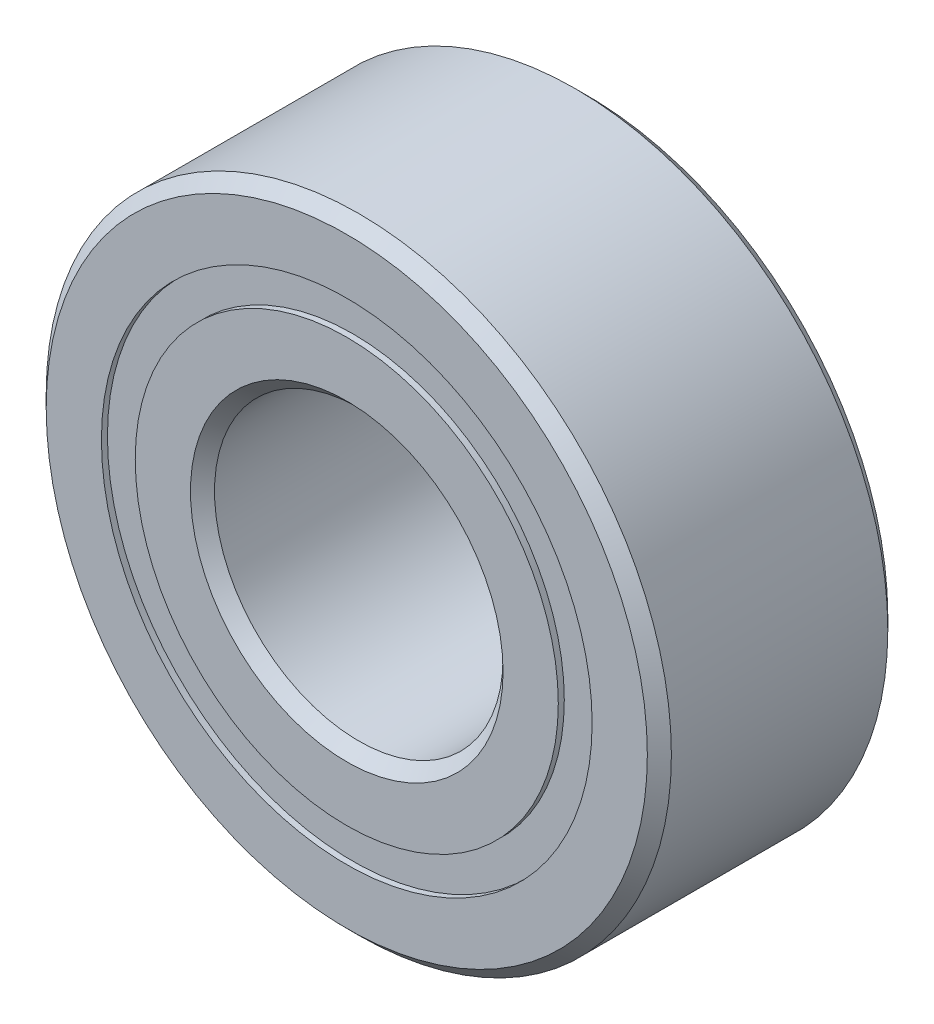
ISO-10303-21;
HEADER;
FILE_DESCRIPTION(('STEP AP214'),'2;1');
FILE_NAME('part.step','',(''),(''),'','','');
FILE_SCHEMA(('AUTOMOTIVE_DESIGN { 1 0 10303 214 1 1 1 1 }'));
ENDSEC;
DATA;
#1=APPLICATION_CONTEXT('core data for automotive mechanical design processes');
#2=APPLICATION_PROTOCOL_DEFINITION('international standard','automotive_design',2000,#1);
#3=PRODUCT_CONTEXT('',#1,'mechanical');
#4=PRODUCT('Part','Part','',(#3));
#5=PRODUCT_RELATED_PRODUCT_CATEGORY('part','',(#4));
#6=PRODUCT_DEFINITION_FORMATION('','',#4);
#7=PRODUCT_DEFINITION_CONTEXT('part definition',#1,'design');
#8=PRODUCT_DEFINITION('design','',#6,#7);
#9=PRODUCT_DEFINITION_SHAPE('','',#8);
#10=(LENGTH_UNIT() NAMED_UNIT(*) SI_UNIT(.MILLI.,.METRE.));
#11=(NAMED_UNIT(*) PLANE_ANGLE_UNIT() SI_UNIT($,.RADIAN.));
#12=(NAMED_UNIT(*) SI_UNIT($,.STERADIAN.) SOLID_ANGLE_UNIT());
#13=UNCERTAINTY_MEASURE_WITH_UNIT(LENGTH_MEASURE(1.E-05),#10,'distance_accuracy_value','');
#14=(GEOMETRIC_REPRESENTATION_CONTEXT(3) GLOBAL_UNCERTAINTY_ASSIGNED_CONTEXT((#13)) GLOBAL_UNIT_ASSIGNED_CONTEXT((#10,
#11,#12)) REPRESENTATION_CONTEXT('',''));
#15=CARTESIAN_POINT('',(0.,0.,0.));
#16=DIRECTION('',(0.,0.,1.));
#17=DIRECTION('',(1.,0.,0.));
#18=AXIS2_PLACEMENT_3D('',#15,#16,#17);
#19=CARTESIAN_POINT('',(0.,5.10164835164835,-2.375));
#20=DIRECTION('',(0.,0.,1.));
#21=DIRECTION('',(1.,0.,0.));
#22=AXIS2_PLACEMENT_3D('',#19,#20,#21);
#23=PLANE('',#22);
#24=CARTESIAN_POINT('',(0.,0.,-2.375));
#25=DIRECTION('',(0.,0.,1.));
#26=DIRECTION('',(1.,0.,0.));
#27=AXIS2_PLACEMENT_3D('',#24,#25,#26);
#28=CIRCLE('',#27,5.10164835164835);
#29=CARTESIAN_POINT('',(5.10164835164835,0.,-2.375));
#30=VERTEX_POINT('',#29);
#31=EDGE_CURVE('E70',#30,#30,#28,.T.);
#32=ORIENTED_EDGE('',*,*,#31,.F.);
#33=EDGE_LOOP('',(#32));
#34=FACE_BOUND('',#33,.T.);
#35=CARTESIAN_POINT('',(0.,0.,-2.375));
#36=DIRECTION('',(0.,0.,1.));
#37=DIRECTION('',(1.,0.,0.));
#38=AXIS2_PLACEMENT_3D('',#35,#36,#37);
#39=CIRCLE('',#38,4.39835164835165);
#40=CARTESIAN_POINT('',(4.39835164835165,0.,-2.375));
#41=VERTEX_POINT('',#40);
#42=EDGE_CURVE('E11',#41,#41,#39,.T.);
#43=ORIENTED_EDGE('',*,*,#42,.T.);
#44=EDGE_LOOP('',(#43));
#45=FACE_BOUND('',#44,.T.);
#46=ADVANCED_FACE('F56',(#34,#45),#23,.F.);
#47=CARTESIAN_POINT('',(0.,0.,2.5));
#48=DIRECTION('',(0.,0.,1.));
#49=DIRECTION('',(1.,0.,0.));
#50=AXIS2_PLACEMENT_3D('',#47,#48,#49);
#51=CYLINDRICAL_SURFACE('',#50,4.39835164835165);
#52=ORIENTED_EDGE('',*,*,#42,.F.);
#53=EDGE_LOOP('',(#52));
#54=FACE_BOUND('',#53,.T.);
#55=CARTESIAN_POINT('',(0.,0.,-1.16542887575844));
#56=DIRECTION('',(0.,0.,1.));
#57=DIRECTION('',(1.,0.,0.));
#58=AXIS2_PLACEMENT_3D('',#55,#56,#57);
#59=CIRCLE('',#58,4.39835164835165);
#60=CARTESIAN_POINT('',(4.39835164835165,0.,-1.16542887575844));
#61=VERTEX_POINT('',#60);
#62=EDGE_CURVE('E62',#61,#61,#59,.T.);
#63=ORIENTED_EDGE('',*,*,#62,.T.);
#64=EDGE_LOOP('',(#63));
#65=FACE_BOUND('',#64,.T.);
#66=ADVANCED_FACE('F79',(#54,#65),#51,.F.);
#67=CARTESIAN_POINT('',(0.,5.10164835164835,-1.16542887575844));
#68=DIRECTION('',(0.,0.,-1.));
#69=DIRECTION('',(-1.,0.,0.));
#70=AXIS2_PLACEMENT_3D('',#67,#68,#69);
#71=PLANE('',#70);
#72=ORIENTED_EDGE('',*,*,#62,.F.);
#73=EDGE_LOOP('',(#72));
#74=FACE_BOUND('',#73,.T.);
#75=CARTESIAN_POINT('',(0.,0.,-1.16542887575844));
#76=DIRECTION('',(0.,0.,1.));
#77=DIRECTION('',(1.,0.,0.));
#78=AXIS2_PLACEMENT_3D('',#75,#76,#77);
#79=CIRCLE('',#78,5.10164835164835);
#80=CARTESIAN_POINT('',(5.10164835164835,0.,-1.16542887575844));
#81=VERTEX_POINT('',#80);
#82=EDGE_CURVE('E66',#81,#81,#79,.T.);
#83=ORIENTED_EDGE('',*,*,#82,.T.);
#84=EDGE_LOOP('',(#83));
#85=FACE_BOUND('',#84,.T.);
#86=ADVANCED_FACE('F83',(#74,#85),#71,.F.);
#87=CARTESIAN_POINT('',(0.,0.,2.5));
#88=DIRECTION('',(0.,0.,1.));
#89=DIRECTION('',(1.,0.,0.));
#90=AXIS2_PLACEMENT_3D('',#87,#88,#89);
#91=CYLINDRICAL_SURFACE('',#90,5.10164835164835);
#92=ORIENTED_EDGE('',*,*,#82,.F.);
#93=EDGE_LOOP('',(#92));
#94=FACE_BOUND('',#93,.T.);
#95=ORIENTED_EDGE('',*,*,#31,.T.);
#96=EDGE_LOOP('',(#95));
#97=FACE_BOUND('',#96,.T.);
#98=ADVANCED_FACE('F76',(#94,#97),#91,.T.);
#99=CLOSED_SHELL('',(#46,#66,#86,#98));
#100=MANIFOLD_SOLID_BREP('B2',#99);
#101=CARTESIAN_POINT('',(0.,5.10164835164835,2.375));
#102=DIRECTION('',(0.,0.,-1.));
#103=DIRECTION('',(-1.,0.,0.));
#104=AXIS2_PLACEMENT_3D('',#101,#102,#103);
#105=PLANE('',#104);
#106=CARTESIAN_POINT('',(0.,0.,2.375));
#107=DIRECTION('',(0.,0.,1.));
#108=DIRECTION('',(1.,0.,0.));
#109=AXIS2_PLACEMENT_3D('',#106,#107,#108);
#110=CIRCLE('',#109,4.39835164835165);
#111=CARTESIAN_POINT('',(4.39835164835165,0.,2.375));
#112=VERTEX_POINT('',#111);
#113=EDGE_CURVE('E55',#112,#112,#110,.T.);
#114=ORIENTED_EDGE('',*,*,#113,.F.);
#115=EDGE_LOOP('',(#114));
#116=FACE_BOUND('',#115,.T.);
#117=CARTESIAN_POINT('',(0.,0.,2.375));
#118=DIRECTION('',(0.,0.,1.));
#119=DIRECTION('',(1.,0.,0.));
#120=AXIS2_PLACEMENT_3D('',#117,#118,#119);
#121=CIRCLE('',#120,5.10164835164835);
#122=CARTESIAN_POINT('',(5.10164835164835,0.,2.375));
#123=VERTEX_POINT('',#122);
#124=EDGE_CURVE('E130',#123,#123,#121,.T.);
#125=ORIENTED_EDGE('',*,*,#124,.T.);
#126=EDGE_LOOP('',(#125));
#127=FACE_BOUND('',#126,.T.);
#128=ADVANCED_FACE('F116',(#116,#127),#105,.F.);
#129=CARTESIAN_POINT('',(0.,0.,2.5));
#130=DIRECTION('',(0.,0.,1.));
#131=DIRECTION('',(1.,0.,0.));
#132=AXIS2_PLACEMENT_3D('',#129,#130,#131);
#133=CYLINDRICAL_SURFACE('',#132,4.39835164835165);
#134=CARTESIAN_POINT('',(0.,0.,1.16542887575844));
#135=DIRECTION('',(0.,0.,1.));
#136=DIRECTION('',(1.,0.,0.));
#137=AXIS2_PLACEMENT_3D('',#134,#135,#136);
#138=CIRCLE('',#137,4.39835164835165);
#139=CARTESIAN_POINT('',(4.39835164835165,0.,1.16542887575844));
#140=VERTEX_POINT('',#139);
#141=EDGE_CURVE('E122',#140,#140,#138,.T.);
#142=ORIENTED_EDGE('',*,*,#141,.F.);
#143=EDGE_LOOP('',(#142));
#144=FACE_BOUND('',#143,.T.);
#145=ORIENTED_EDGE('',*,*,#113,.T.);
#146=EDGE_LOOP('',(#145));
#147=FACE_BOUND('',#146,.T.);
#148=ADVANCED_FACE('F145',(#144,#147),#133,.F.);
#149=CARTESIAN_POINT('',(0.,5.10164835164835,1.16542887575844));
#150=DIRECTION('',(0.,0.,1.));
#151=DIRECTION('',(1.,0.,0.));
#152=AXIS2_PLACEMENT_3D('',#149,#150,#151);
#153=PLANE('',#152);
#154=CARTESIAN_POINT('',(0.,0.,1.16542887575844));
#155=DIRECTION('',(0.,0.,1.));
#156=DIRECTION('',(1.,0.,0.));
#157=AXIS2_PLACEMENT_3D('',#154,#155,#156);
#158=CIRCLE('',#157,5.10164835164835);
#159=CARTESIAN_POINT('',(5.10164835164835,0.,1.16542887575844));
#160=VERTEX_POINT('',#159);
#161=EDGE_CURVE('E126',#160,#160,#158,.T.);
#162=ORIENTED_EDGE('',*,*,#161,.F.);
#163=EDGE_LOOP('',(#162));
#164=FACE_BOUND('',#163,.T.);
#165=ORIENTED_EDGE('',*,*,#141,.T.);
#166=EDGE_LOOP('',(#165));
#167=FACE_BOUND('',#166,.T.);
#168=ADVANCED_FACE('F140',(#164,#167),#153,.F.);
#169=CARTESIAN_POINT('',(0.,0.,2.5));
#170=DIRECTION('',(0.,0.,1.));
#171=DIRECTION('',(1.,0.,0.));
#172=AXIS2_PLACEMENT_3D('',#169,#170,#171);
#173=CYLINDRICAL_SURFACE('',#172,5.10164835164835);
#174=ORIENTED_EDGE('',*,*,#124,.F.);
#175=EDGE_LOOP('',(#174));
#176=FACE_BOUND('',#175,.T.);
#177=ORIENTED_EDGE('',*,*,#161,.T.);
#178=EDGE_LOOP('',(#177));
#179=FACE_BOUND('',#178,.T.);
#180=ADVANCED_FACE('F137',(#176,#179),#173,.T.);
#181=CLOSED_SHELL('',(#128,#148,#168,#180));
#182=MANIFOLD_SOLID_BREP('B6',#181);
#183=CARTESIAN_POINT('',(-2.37499999999995,4.11362066797611,0.));
#184=DIRECTION('',(0.,0.,1.));
#185=DIRECTION('',(-0.499999999999989,0.866025403784445,0.));
#186=AXIS2_PLACEMENT_3D('',#183,#184,#185);
#187=SPHERICAL_SURFACE('',#186,1.16542887575844);
#188=CARTESIAN_POINT('',(-2.37499999999995,4.11362066797611,1.16542887575844));
#189=VERTEX_POINT('',#188);
#190=VERTEX_LOOP('',#189);
#191=FACE_BOUND('',#190,.T.);
#192=ADVANCED_FACE('F176',(#191),#187,.T.);
#193=CLOSED_SHELL('',(#192));
#194=MANIFOLD_SOLID_BREP('B50',#193);
#195=CARTESIAN_POINT('',(-4.11362066797606,2.37500000000005,0.));
#196=DIRECTION('',(0.,0.,1.));
#197=DIRECTION('',(-0.866025403784433,0.50000000000001,0.));
#198=AXIS2_PLACEMENT_3D('',#195,#196,#197);
#199=SPHERICAL_SURFACE('',#198,1.16542887575844);
#200=CARTESIAN_POINT('',(-4.11362066797606,2.37500000000005,1.16542887575844));
#201=VERTEX_POINT('',#200);
#202=VERTEX_LOOP('',#201);
#203=FACE_BOUND('',#202,.T.);
#204=ADVANCED_FACE('F199',(#203),#199,.T.);
#205=CLOSED_SHELL('',(#204));
#206=MANIFOLD_SOLID_BREP('B112',#205);
#207=CARTESIAN_POINT('',(-4.75,0.,0.));
#208=DIRECTION('',(0.,0.,1.));
#209=DIRECTION('',(-1.,0.,0.));
#210=AXIS2_PLACEMENT_3D('',#207,#208,#209);
#211=SPHERICAL_SURFACE('',#210,1.16542887575844);
#212=CARTESIAN_POINT('',(-4.75,0.,1.16542887575844));
#213=VERTEX_POINT('',#212);
#214=VERTEX_LOOP('',#213);
#215=FACE_BOUND('',#214,.T.);
#216=ADVANCED_FACE('F222',(#215),#211,.T.);
#217=CLOSED_SHELL('',(#216));
#218=MANIFOLD_SOLID_BREP('B172',#217);
#219=CARTESIAN_POINT('',(-4.1136206679761,-2.37499999999996,0.));
#220=DIRECTION('',(0.,0.,1.));
#221=DIRECTION('',(-0.866025403784443,-0.499999999999992,0.));
#222=AXIS2_PLACEMENT_3D('',#219,#220,#221);
#223=SPHERICAL_SURFACE('',#222,1.16542887575844);
#224=CARTESIAN_POINT('',(-4.1136206679761,-2.37499999999996,1.16542887575844));
#225=VERTEX_POINT('',#224);
#226=VERTEX_LOOP('',#225);
#227=FACE_BOUND('',#226,.T.);
#228=ADVANCED_FACE('F245',(#227),#223,.T.);
#229=CLOSED_SHELL('',(#228));
#230=MANIFOLD_SOLID_BREP('B195',#229);
#231=CARTESIAN_POINT('',(-2.37500000000003,-4.11362066797606,0.));
#232=DIRECTION('',(0.,0.,1.));
#233=DIRECTION('',(-0.500000000000007,-0.866025403784435,0.));
#234=AXIS2_PLACEMENT_3D('',#231,#232,#233);
#235=SPHERICAL_SURFACE('',#234,1.16542887575844);
#236=CARTESIAN_POINT('',(-2.37500000000003,-4.11362066797606,1.16542887575844));
#237=VERTEX_POINT('',#236);
#238=VERTEX_LOOP('',#237);
#239=FACE_BOUND('',#238,.T.);
#240=ADVANCED_FACE('F268',(#239),#235,.T.);
#241=CLOSED_SHELL('',(#240));
#242=MANIFOLD_SOLID_BREP('B218',#241);
#243=CARTESIAN_POINT('',(0.,-4.75,0.));
#244=DIRECTION('',(0.,0.,1.));
#245=DIRECTION('',(0.,-1.,0.));
#246=AXIS2_PLACEMENT_3D('',#243,#244,#245);
#247=SPHERICAL_SURFACE('',#246,1.16542887575844);
#248=CARTESIAN_POINT('',(0.,-4.75,1.16542887575844));
#249=VERTEX_POINT('',#248);
#250=VERTEX_LOOP('',#249);
#251=FACE_BOUND('',#250,.T.);
#252=ADVANCED_FACE('F291',(#251),#247,.T.);
#253=CLOSED_SHELL('',(#252));
#254=MANIFOLD_SOLID_BREP('B241',#253);
#255=CARTESIAN_POINT('',(2.37499999999998,-4.1136206679761,0.));
#256=DIRECTION('',(0.,0.,1.));
#257=DIRECTION('',(0.499999999999995,-0.866025403784442,0.));
#258=AXIS2_PLACEMENT_3D('',#255,#256,#257);
#259=SPHERICAL_SURFACE('',#258,1.16542887575844);
#260=CARTESIAN_POINT('',(2.37499999999998,-4.1136206679761,1.16542887575844));
#261=VERTEX_POINT('',#260);
#262=VERTEX_LOOP('',#261);
#263=FACE_BOUND('',#262,.T.);
#264=ADVANCED_FACE('F314',(#263),#259,.T.);
#265=CLOSED_SHELL('',(#264));
#266=MANIFOLD_SOLID_BREP('B264',#265);
#267=CARTESIAN_POINT('',(4.11362066797607,-2.37500000000002,0.));
#268=DIRECTION('',(0.,0.,1.));
#269=DIRECTION('',(0.866025403784436,-0.500000000000004,0.));
#270=AXIS2_PLACEMENT_3D('',#267,#268,#269);
#271=SPHERICAL_SURFACE('',#270,1.16542887575844);
#272=CARTESIAN_POINT('',(4.11362066797607,-2.37500000000002,1.16542887575844));
#273=VERTEX_POINT('',#272);
#274=VERTEX_LOOP('',#273);
#275=FACE_BOUND('',#274,.T.);
#276=ADVANCED_FACE('F337',(#275),#271,.T.);
#277=CLOSED_SHELL('',(#276));
#278=MANIFOLD_SOLID_BREP('B287',#277);
#279=CARTESIAN_POINT('',(4.75,0.,0.));
#280=DIRECTION('',(0.,0.,1.));
#281=DIRECTION('',(1.,0.,0.));
#282=AXIS2_PLACEMENT_3D('',#279,#280,#281);
#283=SPHERICAL_SURFACE('',#282,1.16542887575844);
#284=CARTESIAN_POINT('',(4.75,0.,1.16542887575844));
#285=VERTEX_POINT('',#284);
#286=VERTEX_LOOP('',#285);
#287=FACE_BOUND('',#286,.T.);
#288=ADVANCED_FACE('F360',(#287),#283,.T.);
#289=CLOSED_SHELL('',(#288));
#290=MANIFOLD_SOLID_BREP('B310',#289);
#291=CARTESIAN_POINT('',(4.11362066797609,2.37499999999999,0.));
#292=DIRECTION('',(0.,0.,1.));
#293=DIRECTION('',(0.86602540378444,0.499999999999998,0.));
#294=AXIS2_PLACEMENT_3D('',#291,#292,#293);
#295=SPHERICAL_SURFACE('',#294,1.16542887575844);
#296=CARTESIAN_POINT('',(4.11362066797609,2.37499999999999,1.16542887575844));
#297=VERTEX_POINT('',#296);
#298=VERTEX_LOOP('',#297);
#299=FACE_BOUND('',#298,.T.);
#300=ADVANCED_FACE('F383',(#299),#295,.T.);
#301=CLOSED_SHELL('',(#300));
#302=MANIFOLD_SOLID_BREP('B333',#301);
#303=CARTESIAN_POINT('',(2.375,4.11362066797608,0.));
#304=DIRECTION('',(0.,0.,1.));
#305=DIRECTION('',(0.500000000000001,0.866025403784438,0.));
#306=AXIS2_PLACEMENT_3D('',#303,#304,#305);
#307=SPHERICAL_SURFACE('',#306,1.16542887575844);
#308=CARTESIAN_POINT('',(2.375,4.11362066797608,1.16542887575844));
#309=VERTEX_POINT('',#308);
#310=VERTEX_LOOP('',#309);
#311=FACE_BOUND('',#310,.T.);
#312=ADVANCED_FACE('F406',(#311),#307,.T.);
#313=CLOSED_SHELL('',(#312));
#314=MANIFOLD_SOLID_BREP('B356',#313);
#315=CARTESIAN_POINT('',(0.,4.75,0.));
#316=DIRECTION('',(0.,0.,1.));
#317=DIRECTION('',(0.,1.,0.));
#318=AXIS2_PLACEMENT_3D('',#315,#316,#317);
#319=SPHERICAL_SURFACE('',#318,1.16542887575844);
#320=CARTESIAN_POINT('',(0.,4.75,1.16542887575844));
#321=VERTEX_POINT('',#320);
#322=VERTEX_LOOP('',#321);
#323=FACE_BOUND('',#322,.T.);
#324=ADVANCED_FACE('F431',(#323),#319,.T.);
#325=CLOSED_SHELL('',(#324));
#326=MANIFOLD_SOLID_BREP('B379',#325);
#327=CARTESIAN_POINT('',(0.,4.39835164835165,2.5));
#328=DIRECTION('',(0.,0.,-1.));
#329=DIRECTION('',(-1.,0.,0.));
#330=AXIS2_PLACEMENT_3D('',#327,#328,#329);
#331=PLANE('',#330);
#332=CARTESIAN_POINT('',(0.,0.,2.5));
#333=DIRECTION('',(0.,0.,1.));
#334=DIRECTION('',(1.,0.,0.));
#335=AXIS2_PLACEMENT_3D('',#332,#333,#334);
#336=CIRCLE('',#335,3.25);
#337=CARTESIAN_POINT('',(3.25,0.,2.5));
#338=VERTEX_POINT('',#337);
#339=EDGE_CURVE('E477',#338,#338,#336,.T.);
#340=ORIENTED_EDGE('',*,*,#339,.F.);
#341=EDGE_LOOP('',(#340));
#342=FACE_BOUND('',#341,.T.);
#343=CARTESIAN_POINT('',(0.,0.,2.5));
#344=DIRECTION('',(0.,0.,1.));
#345=DIRECTION('',(1.,0.,0.));
#346=AXIS2_PLACEMENT_3D('',#343,#344,#345);
#347=CIRCLE('',#346,4.39835164835165);
#348=CARTESIAN_POINT('',(4.39835164835165,0.,2.5));
#349=VERTEX_POINT('',#348);
#350=EDGE_CURVE('E430',#349,#349,#347,.T.);
#351=ORIENTED_EDGE('',*,*,#350,.T.);
#352=EDGE_LOOP('',(#351));
#353=FACE_BOUND('',#352,.T.);
#354=ADVANCED_FACE('F449',(#342,#353),#331,.F.);
#355=CARTESIAN_POINT('',(0.,0.,2.5));
#356=DIRECTION('',(0.,0.,1.));
#357=DIRECTION('',(1.,0.,0.));
#358=AXIS2_PLACEMENT_3D('',#355,#356,#357);
#359=CYLINDRICAL_SURFACE('',#358,4.39835164835165);
#360=ORIENTED_EDGE('',*,*,#350,.F.);
#361=EDGE_LOOP('',(#360));
#362=FACE_BOUND('',#361,.T.);
#363=CARTESIAN_POINT('',(0.,0.,1.11111111111111));
#364=DIRECTION('',(0.,0.,1.));
#365=DIRECTION('',(1.,0.,0.));
#366=AXIS2_PLACEMENT_3D('',#363,#364,#365);
#367=CIRCLE('',#366,4.39835164835165);
#368=CARTESIAN_POINT('',(4.39835164835165,0.,1.11111111111111));
#369=VERTEX_POINT('',#368);
#370=EDGE_CURVE('E455',#369,#369,#367,.T.);
#371=ORIENTED_EDGE('',*,*,#370,.T.);
#372=EDGE_LOOP('',(#371));
#373=FACE_BOUND('',#372,.T.);
#374=ADVANCED_FACE('F484',(#362,#373),#359,.T.);
#375=CARTESIAN_POINT('',(0.,0.,0.));
#376=DIRECTION('',(0.,0.,1.));
#377=DIRECTION('',(1.,0.,0.));
#378=AXIS2_PLACEMENT_3D('',#375,#376,#377);
#379=TOROIDAL_SURFACE('',#378,4.75,1.16542887575843);
#380=ORIENTED_EDGE('',*,*,#370,.F.);
#381=EDGE_LOOP('',(#380));
#382=FACE_BOUND('',#381,.T.);
#383=CARTESIAN_POINT('',(0.,0.,-1.11111111111111));
#384=DIRECTION('',(0.,0.,1.));
#385=DIRECTION('',(1.,0.,0.));
#386=AXIS2_PLACEMENT_3D('',#383,#384,#385);
#387=CIRCLE('',#386,4.39835164835165);
#388=CARTESIAN_POINT('',(4.39835164835165,0.,-1.11111111111111));
#389=VERTEX_POINT('',#388);
#390=EDGE_CURVE('E459',#389,#389,#387,.T.);
#391=ORIENTED_EDGE('',*,*,#390,.T.);
#392=EDGE_LOOP('',(#391));
#393=FACE_BOUND('',#392,.T.);
#394=ADVANCED_FACE('F488',(#382,#393),#379,.F.);
#395=CARTESIAN_POINT('',(0.,0.,2.5));
#396=DIRECTION('',(0.,0.,1.));
#397=DIRECTION('',(1.,0.,0.));
#398=AXIS2_PLACEMENT_3D('',#395,#396,#397);
#399=CYLINDRICAL_SURFACE('',#398,4.39835164835165);
#400=ORIENTED_EDGE('',*,*,#390,.F.);
#401=EDGE_LOOP('',(#400));
#402=FACE_BOUND('',#401,.T.);
#403=CARTESIAN_POINT('',(0.,0.,-2.5));
#404=DIRECTION('',(0.,0.,1.));
#405=DIRECTION('',(1.,0.,0.));
#406=AXIS2_PLACEMENT_3D('',#403,#404,#405);
#407=CIRCLE('',#406,4.39835164835165);
#408=CARTESIAN_POINT('',(4.39835164835165,0.,-2.5));
#409=VERTEX_POINT('',#408);
#410=EDGE_CURVE('E463',#409,#409,#407,.T.);
#411=ORIENTED_EDGE('',*,*,#410,.T.);
#412=EDGE_LOOP('',(#411));
#413=FACE_BOUND('',#412,.T.);
#414=ADVANCED_FACE('F493',(#402,#413),#399,.T.);
#415=CARTESIAN_POINT('',(0.,3.25,-2.5));
#416=DIRECTION('',(0.,0.,1.));
#417=DIRECTION('',(1.,0.,0.));
#418=AXIS2_PLACEMENT_3D('',#415,#416,#417);
#419=PLANE('',#418);
#420=ORIENTED_EDGE('',*,*,#410,.F.);
#421=EDGE_LOOP('',(#420));
#422=FACE_BOUND('',#421,.T.);
#423=CARTESIAN_POINT('',(0.,0.,-2.5));
#424=DIRECTION('',(0.,0.,1.));
#425=DIRECTION('',(1.,0.,0.));
#426=AXIS2_PLACEMENT_3D('',#423,#424,#425);
#427=CIRCLE('',#426,3.25);
#428=CARTESIAN_POINT('',(3.25,0.,-2.5));
#429=VERTEX_POINT('',#428);
#430=EDGE_CURVE('E468',#429,#429,#427,.T.);
#431=ORIENTED_EDGE('',*,*,#430,.T.);
#432=EDGE_LOOP('',(#431));
#433=FACE_BOUND('',#432,.T.);
#434=ADVANCED_FACE('F499',(#422,#433),#419,.F.);
#435=CARTESIAN_POINT('',(0.,0.,-2.25));
#436=DIRECTION('',(0.,0.,-1.));
#437=DIRECTION('',(-1.,0.,0.));
#438=AXIS2_PLACEMENT_3D('',#435,#436,#437);
#439=CONICAL_SURFACE('',#438,3.,0.785398163397447);
#440=ORIENTED_EDGE('',*,*,#430,.F.);
#441=EDGE_LOOP('',(#440));
#442=FACE_BOUND('',#441,.T.);
#443=CARTESIAN_POINT('',(0.,0.,-2.25));
#444=DIRECTION('',(0.,0.,1.));
#445=DIRECTION('',(1.,0.,0.));
#446=AXIS2_PLACEMENT_3D('',#443,#444,#445);
#447=CIRCLE('',#446,3.);
#448=CARTESIAN_POINT('',(3.,0.,-2.25));
#449=VERTEX_POINT('',#448);
#450=EDGE_CURVE('E471',#449,#449,#447,.T.);
#451=ORIENTED_EDGE('',*,*,#450,.T.);
#452=EDGE_LOOP('',(#451));
#453=FACE_BOUND('',#452,.T.);
#454=ADVANCED_FACE('F503',(#442,#453),#439,.F.);
#455=CARTESIAN_POINT('',(0.,0.,2.5));
#456=DIRECTION('',(0.,0.,1.));
#457=DIRECTION('',(1.,0.,0.));
#458=AXIS2_PLACEMENT_3D('',#455,#456,#457);
#459=CYLINDRICAL_SURFACE('',#458,3.);
#460=ORIENTED_EDGE('',*,*,#450,.F.);
#461=EDGE_LOOP('',(#460));
#462=FACE_BOUND('',#461,.T.);
#463=CARTESIAN_POINT('',(0.,0.,2.25));
#464=DIRECTION('',(0.,0.,1.));
#465=DIRECTION('',(1.,0.,0.));
#466=AXIS2_PLACEMENT_3D('',#463,#464,#465);
#467=CIRCLE('',#466,3.);
#468=CARTESIAN_POINT('',(3.,0.,2.25));
#469=VERTEX_POINT('',#468);
#470=EDGE_CURVE('E474',#469,#469,#467,.T.);
#471=ORIENTED_EDGE('',*,*,#470,.T.);
#472=EDGE_LOOP('',(#471));
#473=FACE_BOUND('',#472,.T.);
#474=ADVANCED_FACE('F507',(#462,#473),#459,.F.);
#475=CARTESIAN_POINT('',(0.,0.,2.5));
#476=DIRECTION('',(0.,0.,1.));
#477=DIRECTION('',(1.,0.,0.));
#478=AXIS2_PLACEMENT_3D('',#475,#476,#477);
#479=CONICAL_SURFACE('',#478,3.25,0.785398163397452);
#480=ORIENTED_EDGE('',*,*,#470,.F.);
#481=EDGE_LOOP('',(#480));
#482=FACE_BOUND('',#481,.T.);
#483=ORIENTED_EDGE('',*,*,#339,.T.);
#484=EDGE_LOOP('',(#483));
#485=FACE_BOUND('',#484,.T.);
#486=ADVANCED_FACE('F481',(#482,#485),#479,.F.);
#487=CLOSED_SHELL('',(#354,#374,#394,#414,#434,#454,#474,#486));
#488=MANIFOLD_SOLID_BREP('B402',#487);
#489=CARTESIAN_POINT('',(0.,0.,2.25));
#490=DIRECTION('',(0.,0.,-1.));
#491=DIRECTION('',(-1.,0.,0.));
#492=AXIS2_PLACEMENT_3D('',#489,#490,#491);
#493=CONICAL_SURFACE('',#492,6.5,0.785398163397445);
#494=CARTESIAN_POINT('',(0.,0.,2.5));
#495=DIRECTION('',(0.,0.,1.));
#496=DIRECTION('',(1.,0.,0.));
#497=AXIS2_PLACEMENT_3D('',#494,#495,#496);
#498=CIRCLE('',#497,6.25);
#499=CARTESIAN_POINT('',(6.25,0.,2.5));
#500=VERTEX_POINT('',#499);
#501=EDGE_CURVE('E590',#500,#500,#498,.T.);
#502=ORIENTED_EDGE('',*,*,#501,.F.);
#503=EDGE_LOOP('',(#502));
#504=FACE_BOUND('',#503,.T.);
#505=CARTESIAN_POINT('',(0.,0.,2.25));
#506=DIRECTION('',(0.,0.,1.));
#507=DIRECTION('',(1.,0.,0.));
#508=AXIS2_PLACEMENT_3D('',#505,#506,#507);
#509=CIRCLE('',#508,6.5);
#510=CARTESIAN_POINT('',(6.5,0.,2.25));
#511=VERTEX_POINT('',#510);
#512=EDGE_CURVE('E448',#511,#511,#509,.T.);
#513=ORIENTED_EDGE('',*,*,#512,.T.);
#514=EDGE_LOOP('',(#513));
#515=FACE_BOUND('',#514,.T.);
#516=ADVANCED_FACE('F555',(#504,#515),#493,.T.);
#517=CARTESIAN_POINT('',(0.,0.,2.5));
#518=DIRECTION('',(0.,0.,1.));
#519=DIRECTION('',(1.,0.,0.));
#520=AXIS2_PLACEMENT_3D('',#517,#518,#519);
#521=CYLINDRICAL_SURFACE('',#520,6.5);
#522=ORIENTED_EDGE('',*,*,#512,.F.);
#523=EDGE_LOOP('',(#522));
#524=FACE_BOUND('',#523,.T.);
#525=CARTESIAN_POINT('',(0.,0.,-2.25));
#526=DIRECTION('',(0.,0.,1.));
#527=DIRECTION('',(1.,0.,0.));
#528=AXIS2_PLACEMENT_3D('',#525,#526,#527);
#529=CIRCLE('',#528,6.5);
#530=CARTESIAN_POINT('',(6.5,0.,-2.25));
#531=VERTEX_POINT('',#530);
#532=EDGE_CURVE('E562',#531,#531,#529,.T.);
#533=ORIENTED_EDGE('',*,*,#532,.T.);
#534=EDGE_LOOP('',(#533));
#535=FACE_BOUND('',#534,.T.);
#536=ADVANCED_FACE('F598',(#524,#535),#521,.T.);
#537=CARTESIAN_POINT('',(0.,0.,-2.5));
#538=DIRECTION('',(0.,0.,1.));
#539=DIRECTION('',(1.,0.,0.));
#540=AXIS2_PLACEMENT_3D('',#537,#538,#539);
#541=CONICAL_SURFACE('',#540,6.25,0.785398163397445);
#542=ORIENTED_EDGE('',*,*,#532,.F.);
#543=EDGE_LOOP('',(#542));
#544=FACE_BOUND('',#543,.T.);
#545=CARTESIAN_POINT('',(0.,0.,-2.5));
#546=DIRECTION('',(0.,0.,1.));
#547=DIRECTION('',(1.,0.,0.));
#548=AXIS2_PLACEMENT_3D('',#545,#546,#547);
#549=CIRCLE('',#548,6.25);
#550=CARTESIAN_POINT('',(6.25,0.,-2.5));
#551=VERTEX_POINT('',#550);
#552=EDGE_CURVE('E567',#551,#551,#549,.T.);
#553=ORIENTED_EDGE('',*,*,#552,.T.);
#554=EDGE_LOOP('',(#553));
#555=FACE_BOUND('',#554,.T.);
#556=ADVANCED_FACE('F602',(#544,#555),#541,.T.);
#557=CARTESIAN_POINT('',(0.,6.25,-2.5));
#558=DIRECTION('',(0.,0.,1.));
#559=DIRECTION('',(1.,0.,0.));
#560=AXIS2_PLACEMENT_3D('',#557,#558,#559);
#561=PLANE('',#560);
#562=ORIENTED_EDGE('',*,*,#552,.F.);
#563=EDGE_LOOP('',(#562));
#564=FACE_BOUND('',#563,.T.);
#565=CARTESIAN_POINT('',(0.,0.,-2.5));
#566=DIRECTION('',(0.,0.,1.));
#567=DIRECTION('',(1.,0.,0.));
#568=AXIS2_PLACEMENT_3D('',#565,#566,#567);
#569=CIRCLE('',#568,5.10164835164835);
#570=CARTESIAN_POINT('',(5.10164835164835,0.,-2.5));
#571=VERTEX_POINT('',#570);
#572=EDGE_CURVE('E572',#571,#571,#569,.T.);
#573=ORIENTED_EDGE('',*,*,#572,.T.);
#574=EDGE_LOOP('',(#573));
#575=FACE_BOUND('',#574,.T.);
#576=ADVANCED_FACE('F607',(#564,#575),#561,.F.);
#577=CARTESIAN_POINT('',(0.,0.,2.5));
#578=DIRECTION('',(0.,0.,1.));
#579=DIRECTION('',(1.,0.,0.));
#580=AXIS2_PLACEMENT_3D('',#577,#578,#579);
#581=CYLINDRICAL_SURFACE('',#580,5.10164835164835);
#582=ORIENTED_EDGE('',*,*,#572,.F.);
#583=EDGE_LOOP('',(#582));
#584=FACE_BOUND('',#583,.T.);
#585=CARTESIAN_POINT('',(0.,0.,-1.11111111111111));
#586=DIRECTION('',(0.,0.,1.));
#587=DIRECTION('',(1.,0.,0.));
#588=AXIS2_PLACEMENT_3D('',#585,#586,#587);
#589=CIRCLE('',#588,5.10164835164835);
#590=CARTESIAN_POINT('',(5.10164835164835,0.,-1.11111111111111));
#591=VERTEX_POINT('',#590);
#592=EDGE_CURVE('E578',#591,#591,#589,.T.);
#593=ORIENTED_EDGE('',*,*,#592,.T.);
#594=EDGE_LOOP('',(#593));
#595=FACE_BOUND('',#594,.T.);
#596=ADVANCED_FACE('F613',(#584,#595),#581,.F.);
#597=CARTESIAN_POINT('',(0.,0.,0.));
#598=DIRECTION('',(0.,0.,1.));
#599=DIRECTION('',(1.,0.,0.));
#600=AXIS2_PLACEMENT_3D('',#597,#598,#599);
#601=TOROIDAL_SURFACE('',#600,4.75,1.16542887575844);
#602=ORIENTED_EDGE('',*,*,#592,.F.);
#603=EDGE_LOOP('',(#602));
#604=FACE_BOUND('',#603,.T.);
#605=CARTESIAN_POINT('',(0.,0.,1.11111111111111));
#606=DIRECTION('',(0.,0.,1.));
#607=DIRECTION('',(1.,0.,0.));
#608=AXIS2_PLACEMENT_3D('',#605,#606,#607);
#609=CIRCLE('',#608,5.10164835164835);
#610=CARTESIAN_POINT('',(5.10164835164835,0.,1.11111111111111));
#611=VERTEX_POINT('',#610);
#612=EDGE_CURVE('E582',#611,#611,#609,.T.);
#613=ORIENTED_EDGE('',*,*,#612,.T.);
#614=EDGE_LOOP('',(#613));
#615=FACE_BOUND('',#614,.T.);
#616=ADVANCED_FACE('F617',(#604,#615),#601,.F.);
#617=CARTESIAN_POINT('',(0.,0.,2.5));
#618=DIRECTION('',(0.,0.,1.));
#619=DIRECTION('',(1.,0.,0.));
#620=AXIS2_PLACEMENT_3D('',#617,#618,#619);
#621=CYLINDRICAL_SURFACE('',#620,5.10164835164835);
#622=ORIENTED_EDGE('',*,*,#612,.F.);
#623=EDGE_LOOP('',(#622));
#624=FACE_BOUND('',#623,.T.);
#625=CARTESIAN_POINT('',(0.,0.,2.5));
#626=DIRECTION('',(0.,0.,1.));
#627=DIRECTION('',(1.,0.,0.));
#628=AXIS2_PLACEMENT_3D('',#625,#626,#627);
#629=CIRCLE('',#628,5.10164835164835);
#630=CARTESIAN_POINT('',(5.10164835164835,0.,2.5));
#631=VERTEX_POINT('',#630);
#632=EDGE_CURVE('E586',#631,#631,#629,.T.);
#633=ORIENTED_EDGE('',*,*,#632,.T.);
#634=EDGE_LOOP('',(#633));
#635=FACE_BOUND('',#634,.T.);
#636=ADVANCED_FACE('F621',(#624,#635),#621,.F.);
#637=CARTESIAN_POINT('',(0.,6.25,2.5));
#638=DIRECTION('',(0.,0.,-1.));
#639=DIRECTION('',(-1.,0.,0.));
#640=AXIS2_PLACEMENT_3D('',#637,#638,#639);
#641=PLANE('',#640);
#642=ORIENTED_EDGE('',*,*,#632,.F.);
#643=EDGE_LOOP('',(#642));
#644=FACE_BOUND('',#643,.T.);
#645=ORIENTED_EDGE('',*,*,#501,.T.);
#646=EDGE_LOOP('',(#645));
#647=FACE_BOUND('',#646,.T.);
#648=ADVANCED_FACE('F595',(#644,#647),#641,.F.);
#649=CLOSED_SHELL('',(#516,#536,#556,#576,#596,#616,#636,#648));
#650=MANIFOLD_SOLID_BREP('B425',#649);
#651=ADVANCED_BREP_SHAPE_REPRESENTATION('',(#18,#100,#182,#194,#206,#218,#230,#242,#254,#266,
#278,#290,#302,#314,#326,#488,#650),#14);
#652=SHAPE_DEFINITION_REPRESENTATION(#9,#651);
ENDSEC;
END-ISO-10303-21;
